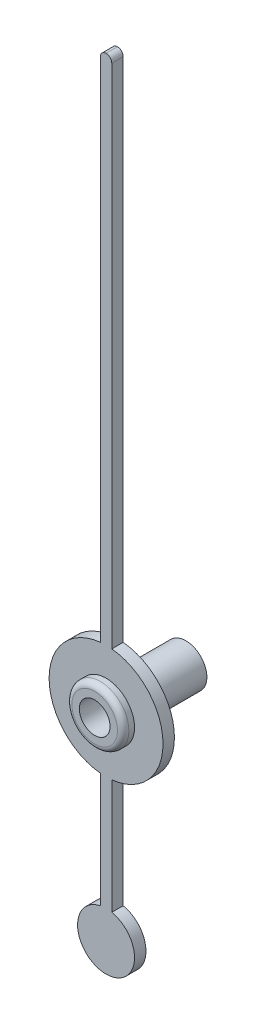
ISO-10303-21;
HEADER;
FILE_DESCRIPTION(('STEP AP214'),'2;1');
FILE_NAME('part.step','',(''),(''),'','','');
FILE_SCHEMA(('AUTOMOTIVE_DESIGN { 1 0 10303 214 1 1 1 1 }'));
ENDSEC;
DATA;
#1=APPLICATION_CONTEXT('core data for automotive mechanical design processes');
#2=APPLICATION_PROTOCOL_DEFINITION('international standard','automotive_design',2000,#1);
#3=PRODUCT_CONTEXT('',#1,'mechanical');
#4=PRODUCT('Part','Part','',(#3));
#5=PRODUCT_RELATED_PRODUCT_CATEGORY('part','',(#4));
#6=PRODUCT_DEFINITION_FORMATION('','',#4);
#7=PRODUCT_DEFINITION_CONTEXT('part definition',#1,'design');
#8=PRODUCT_DEFINITION('design','',#6,#7);
#9=PRODUCT_DEFINITION_SHAPE('','',#8);
#10=(LENGTH_UNIT() NAMED_UNIT(*) SI_UNIT(.MILLI.,.METRE.));
#11=(NAMED_UNIT(*) PLANE_ANGLE_UNIT() SI_UNIT($,.RADIAN.));
#12=(NAMED_UNIT(*) SI_UNIT($,.STERADIAN.) SOLID_ANGLE_UNIT());
#13=UNCERTAINTY_MEASURE_WITH_UNIT(LENGTH_MEASURE(1.E-05),#10,'distance_accuracy_value','');
#14=(GEOMETRIC_REPRESENTATION_CONTEXT(3) GLOBAL_UNCERTAINTY_ASSIGNED_CONTEXT((#13)) GLOBAL_UNIT_ASSIGNED_CONTEXT((#10,
#11,#12)) REPRESENTATION_CONTEXT('',''));
#15=CARTESIAN_POINT('',(0.,0.,0.));
#16=DIRECTION('',(0.,0.,1.));
#17=DIRECTION('',(1.,0.,0.));
#18=AXIS2_PLACEMENT_3D('',#15,#16,#17);
#19=CARTESIAN_POINT('',(0.,0.,-0.1));
#20=DIRECTION('',(0.,0.,1.));
#21=DIRECTION('',(1.,0.,0.));
#22=AXIS2_PLACEMENT_3D('',#19,#20,#21);
#23=PLANE('',#22);
#24=CARTESIAN_POINT('',(0.,0.,-0.1));
#25=DIRECTION('',(0.,0.,1.));
#26=DIRECTION('',(1.,0.,0.));
#27=AXIS2_PLACEMENT_3D('',#24,#25,#26);
#28=CIRCLE('',#27,0.2);
#29=CARTESIAN_POINT('',(0.2,0.,-0.1));
#30=VERTEX_POINT('',#29);
#31=EDGE_CURVE('E187',#30,#30,#28,.F.);
#32=ORIENTED_EDGE('',*,*,#31,.T.);
#33=EDGE_LOOP('',(#32));
#34=FACE_BOUND('',#33,.T.);
#35=CARTESIAN_POINT('',(0.,0.,-0.1));
#36=DIRECTION('',(0.,0.,1.));
#37=DIRECTION('',(1.,0.,0.));
#38=AXIS2_PLACEMENT_3D('',#35,#36,#37);
#39=CIRCLE('',#38,0.185);
#40=CARTESIAN_POINT('',(0.185,0.,-0.1));
#41=VERTEX_POINT('',#40);
#42=EDGE_CURVE('E11',#41,#41,#39,.F.);
#43=ORIENTED_EDGE('',*,*,#42,.F.);
#44=EDGE_LOOP('',(#43));
#45=FACE_BOUND('',#44,.T.);
#46=ADVANCED_FACE('F35',(#34,#45),#23,.F.);
#47=CARTESIAN_POINT('',(0.0499999999937245,4.99999999999773,0.1));
#48=DIRECTION('',(-1.,-1.35877854053416E-12,0.));
#49=DIRECTION('',(1.35877854053416E-12,-1.,0.));
#50=AXIS2_PLACEMENT_3D('',#47,#48,#49);
#51=PLANE('',#50);
#52=DIRECTION('',(-1.35877854053416E-12,1.,0.));
#53=VECTOR('',#52,1.);
#54=CARTESIAN_POINT('',(0.0499999999937245,4.99999999999773,0.));
#55=LINE('',#54,#53);
#56=CARTESIAN_POINT('',(0.0499999999998423,0.497493718553326,0.));
#57=VERTEX_POINT('',#56);
#58=CARTESIAN_POINT('',(0.0499999999937924,4.94999999999779,0.));
#59=VERTEX_POINT('',#58);
#60=EDGE_CURVE('E144',#57,#59,#55,.T.);
#61=ORIENTED_EDGE('',*,*,#60,.T.);
#62=DIRECTION('',(0.,0.,-1.));
#63=VECTOR('',#62,1.);
#64=CARTESIAN_POINT('',(0.0499999999937924,4.94999999999779,0.1));
#65=LINE('',#64,#63);
#66=CARTESIAN_POINT('',(0.0499999999937924,4.94999999999779,0.1));
#67=VERTEX_POINT('',#66);
#68=EDGE_CURVE('E58',#59,#67,#65,.F.);
#69=ORIENTED_EDGE('',*,*,#68,.T.);
#70=DIRECTION('',(-1.35877854053416E-12,1.,0.));
#71=VECTOR('',#70,1.);
#72=CARTESIAN_POINT('',(0.0499999999937245,4.99999999999773,0.1));
#73=LINE('',#72,#71);
#74=CARTESIAN_POINT('',(0.0499999999998423,0.497493718553326,0.1));
#75=VERTEX_POINT('',#74);
#76=EDGE_CURVE('E117',#75,#67,#73,.T.);
#77=ORIENTED_EDGE('',*,*,#76,.F.);
#78=DIRECTION('',(0.,0.,-1.));
#79=VECTOR('',#78,1.);
#80=CARTESIAN_POINT('',(0.0499999999998423,0.497493718553326,0.1));
#81=LINE('',#80,#79);
#82=EDGE_CURVE('E143',#75,#57,#81,.T.);
#83=ORIENTED_EDGE('',*,*,#82,.T.);
#84=EDGE_LOOP('',(#61,#69,#77,#83));
#85=FACE_BOUND('',#84,.T.);
#86=ADVANCED_FACE('F248',(#85),#51,.F.);
#87=CARTESIAN_POINT('',(-0.0499999999937594,4.99999999999773,0.1));
#88=DIRECTION('',(1.,-1.35179534916546E-12,0.));
#89=DIRECTION('',(1.35179534916546E-12,1.,0.));
#90=AXIS2_PLACEMENT_3D('',#87,#88,#89);
#91=PLANE('',#90);
#92=DIRECTION('',(-1.35179534916546E-12,-1.,0.));
#93=VECTOR('',#92,1.);
#94=CARTESIAN_POINT('',(-0.0499999999937594,4.99999999999773,0.1));
#95=LINE('',#94,#93);
#96=CARTESIAN_POINT('',(-0.049999999993827,4.94999999999779,0.1));
#97=VERTEX_POINT('',#96);
#98=CARTESIAN_POINT('',(-0.0499999999998459,0.497493718553326,0.1));
#99=VERTEX_POINT('',#98);
#100=EDGE_CURVE('E106',#97,#99,#95,.T.);
#101=ORIENTED_EDGE('',*,*,#100,.F.);
#102=DIRECTION('',(0.,0.,-1.));
#103=VECTOR('',#102,1.);
#104=CARTESIAN_POINT('',(-0.049999999993827,4.94999999999779,0.1));
#105=LINE('',#104,#103);
#106=CARTESIAN_POINT('',(-0.049999999993827,4.94999999999779,0.));
#107=VERTEX_POINT('',#106);
#108=EDGE_CURVE('E126',#97,#107,#105,.T.);
#109=ORIENTED_EDGE('',*,*,#108,.T.);
#110=DIRECTION('',(-1.35179534916546E-12,-1.,0.));
#111=VECTOR('',#110,1.);
#112=CARTESIAN_POINT('',(-0.0499999999937594,4.99999999999773,0.));
#113=LINE('',#112,#111);
#114=CARTESIAN_POINT('',(-0.0499999999998459,0.497493718553326,0.));
#115=VERTEX_POINT('',#114);
#116=EDGE_CURVE('E123',#107,#115,#113,.T.);
#117=ORIENTED_EDGE('',*,*,#116,.T.);
#118=DIRECTION('',(0.,0.,-1.));
#119=VECTOR('',#118,1.);
#120=CARTESIAN_POINT('',(-0.0499999999998459,0.497493718553326,0.1));
#121=LINE('',#120,#119);
#122=EDGE_CURVE('E120',#99,#115,#121,.T.);
#123=ORIENTED_EDGE('',*,*,#122,.F.);
#124=EDGE_LOOP('',(#101,#109,#117,#123));
#125=FACE_BOUND('',#124,.T.);
#126=ADVANCED_FACE('F121',(#125),#91,.F.);
#127=CARTESIAN_POINT('',(0.,0.,0.1));
#128=DIRECTION('',(0.,0.,-1.));
#129=DIRECTION('',(-1.,0.,0.));
#130=AXIS2_PLACEMENT_3D('',#127,#128,#129);
#131=CYLINDRICAL_SURFACE('',#130,0.5);
#132=CARTESIAN_POINT('',(0.,0.,0.));
#133=DIRECTION('',(0.,0.,1.));
#134=DIRECTION('',(1.,0.,0.));
#135=AXIS2_PLACEMENT_3D('',#132,#133,#134);
#136=CIRCLE('',#135,0.5);
#137=CARTESIAN_POINT('',(-0.0499999999998043,-0.49749371855333,0.));
#138=VERTEX_POINT('',#137);
#139=EDGE_CURVE('E148',#115,#138,#136,.T.);
#140=ORIENTED_EDGE('',*,*,#139,.T.);
#141=DIRECTION('',(0.,0.,-1.));
#142=VECTOR('',#141,1.);
#143=CARTESIAN_POINT('',(-0.0499999999998043,-0.49749371855333,0.1));
#144=LINE('',#143,#142);
#145=CARTESIAN_POINT('',(-0.0499999999998043,-0.49749371855333,0.1));
#146=VERTEX_POINT('',#145);
#147=EDGE_CURVE('E127',#146,#138,#144,.T.);
#148=ORIENTED_EDGE('',*,*,#147,.F.);
#149=CARTESIAN_POINT('',(0.,0.,0.1));
#150=DIRECTION('',(0.,0.,1.));
#151=DIRECTION('',(1.,0.,0.));
#152=AXIS2_PLACEMENT_3D('',#149,#150,#151);
#153=CIRCLE('',#152,0.5);
#154=EDGE_CURVE('E110',#99,#146,#153,.T.);
#155=ORIENTED_EDGE('',*,*,#154,.F.);
#156=ORIENTED_EDGE('',*,*,#122,.T.);
#157=EDGE_LOOP('',(#140,#148,#155,#156));
#158=FACE_BOUND('',#157,.T.);
#159=ADVANCED_FACE('F129',(#158),#131,.T.);
#160=CARTESIAN_POINT('',(-0.0499999999998041,-0.497493718553329,0.1));
#161=DIRECTION('',(1.,0.,0.));
#162=DIRECTION('',(0.,1.,0.));
#163=AXIS2_PLACEMENT_3D('',#160,#161,#162);
#164=PLANE('',#163);
#165=DIRECTION('',(0.,-1.,0.));
#166=VECTOR('',#165,1.);
#167=CARTESIAN_POINT('',(-0.0499999999998041,-0.497493718553329,0.));
#168=LINE('',#167,#166);
#169=CARTESIAN_POINT('',(-0.0499999999997618,-1.50505102572167,0.));
#170=VERTEX_POINT('',#169);
#171=EDGE_CURVE('E150',#138,#170,#168,.T.);
#172=ORIENTED_EDGE('',*,*,#171,.T.);
#173=DIRECTION('',(0.,0.,-1.));
#174=VECTOR('',#173,1.);
#175=CARTESIAN_POINT('',(-0.0499999999997618,-1.50505102572167,0.1));
#176=LINE('',#175,#174);
#177=CARTESIAN_POINT('',(-0.0499999999997618,-1.50505102572167,0.1));
#178=VERTEX_POINT('',#177);
#179=EDGE_CURVE('E166',#178,#170,#176,.T.);
#180=ORIENTED_EDGE('',*,*,#179,.F.);
#181=DIRECTION('',(0.,-1.,0.));
#182=VECTOR('',#181,1.);
#183=CARTESIAN_POINT('',(-0.0499999999998041,-0.497493718553329,0.1));
#184=LINE('',#183,#182);
#185=EDGE_CURVE('E132',#146,#178,#184,.T.);
#186=ORIENTED_EDGE('',*,*,#185,.F.);
#187=ORIENTED_EDGE('',*,*,#147,.T.);
#188=EDGE_LOOP('',(#172,#180,#186,#187));
#189=FACE_BOUND('',#188,.T.);
#190=ADVANCED_FACE('F233',(#189),#164,.F.);
#191=CARTESIAN_POINT('',(0.,-1.75000000000003,0.1));
#192=DIRECTION('',(0.,0.,-1.));
#193=DIRECTION('',(-1.,0.,0.));
#194=AXIS2_PLACEMENT_3D('',#191,#192,#193);
#195=CYLINDRICAL_SURFACE('',#194,0.249999999999999);
#196=CARTESIAN_POINT('',(0.,-1.75000000000003,0.));
#197=DIRECTION('',(0.,0.,1.));
#198=DIRECTION('',(1.,0.,0.));
#199=AXIS2_PLACEMENT_3D('',#196,#197,#198);
#200=CIRCLE('',#199,0.249999999999999);
#201=CARTESIAN_POINT('',(0.049999999999772,-1.50505102572167,0.));
#202=VERTEX_POINT('',#201);
#203=EDGE_CURVE('E152',#170,#202,#200,.T.);
#204=ORIENTED_EDGE('',*,*,#203,.T.);
#205=DIRECTION('',(0.,0.,-1.));
#206=VECTOR('',#205,1.);
#207=CARTESIAN_POINT('',(0.049999999999772,-1.50505102572167,0.1));
#208=LINE('',#207,#206);
#209=CARTESIAN_POINT('',(0.049999999999772,-1.50505102572167,0.1));
#210=VERTEX_POINT('',#209);
#211=EDGE_CURVE('E163',#210,#202,#208,.T.);
#212=ORIENTED_EDGE('',*,*,#211,.F.);
#213=CARTESIAN_POINT('',(0.,-1.75000000000003,0.1));
#214=DIRECTION('',(0.,0.,1.));
#215=DIRECTION('',(1.,0.,0.));
#216=AXIS2_PLACEMENT_3D('',#213,#214,#215);
#217=CIRCLE('',#216,0.249999999999999);
#218=EDGE_CURVE('E134',#178,#210,#217,.T.);
#219=ORIENTED_EDGE('',*,*,#218,.F.);
#220=ORIENTED_EDGE('',*,*,#179,.T.);
#221=EDGE_LOOP('',(#204,#212,#219,#220));
#222=FACE_BOUND('',#221,.T.);
#223=ADVANCED_FACE('F240',(#222),#195,.T.);
#224=CARTESIAN_POINT('',(0.0499999999998076,-0.497493718553329,0.1));
#225=DIRECTION('',(-1.,0.,0.));
#226=DIRECTION('',(0.,-1.,0.));
#227=AXIS2_PLACEMENT_3D('',#224,#225,#226);
#228=PLANE('',#227);
#229=DIRECTION('',(0.,1.,0.));
#230=VECTOR('',#229,1.);
#231=CARTESIAN_POINT('',(0.0499999999998076,-0.497493718553329,0.));
#232=LINE('',#231,#230);
#233=CARTESIAN_POINT('',(0.0499999999998076,-0.497493718553329,0.));
#234=VERTEX_POINT('',#233);
#235=EDGE_CURVE('E154',#202,#234,#232,.T.);
#236=ORIENTED_EDGE('',*,*,#235,.T.);
#237=DIRECTION('',(0.,0.,-1.));
#238=VECTOR('',#237,1.);
#239=CARTESIAN_POINT('',(0.0499999999998076,-0.497493718553329,0.1));
#240=LINE('',#239,#238);
#241=CARTESIAN_POINT('',(0.0499999999998076,-0.497493718553329,0.1));
#242=VERTEX_POINT('',#241);
#243=EDGE_CURVE('E160',#242,#234,#240,.T.);
#244=ORIENTED_EDGE('',*,*,#243,.F.);
#245=DIRECTION('',(0.,1.,0.));
#246=VECTOR('',#245,1.);
#247=CARTESIAN_POINT('',(0.0499999999998076,-0.497493718553329,0.1));
#248=LINE('',#247,#246);
#249=EDGE_CURVE('E139',#210,#242,#248,.T.);
#250=ORIENTED_EDGE('',*,*,#249,.F.);
#251=ORIENTED_EDGE('',*,*,#211,.T.);
#252=EDGE_LOOP('',(#236,#244,#250,#251));
#253=FACE_BOUND('',#252,.T.);
#254=ADVANCED_FACE('F243',(#253),#228,.F.);
#255=CARTESIAN_POINT('',(0.,0.,0.1));
#256=DIRECTION('',(0.,0.,-1.));
#257=DIRECTION('',(-1.,0.,0.));
#258=AXIS2_PLACEMENT_3D('',#255,#256,#257);
#259=CYLINDRICAL_SURFACE('',#258,0.5);
#260=CARTESIAN_POINT('',(0.,0.,0.));
#261=DIRECTION('',(0.,0.,1.));
#262=DIRECTION('',(1.,0.,0.));
#263=AXIS2_PLACEMENT_3D('',#260,#261,#262);
#264=CIRCLE('',#263,0.5);
#265=EDGE_CURVE('E156',#234,#57,#264,.T.);
#266=ORIENTED_EDGE('',*,*,#265,.T.);
#267=ORIENTED_EDGE('',*,*,#82,.F.);
#268=CARTESIAN_POINT('',(0.,0.,0.1));
#269=DIRECTION('',(0.,0.,1.));
#270=DIRECTION('',(1.,0.,0.));
#271=AXIS2_PLACEMENT_3D('',#268,#269,#270);
#272=CIRCLE('',#271,0.5);
#273=EDGE_CURVE('E141',#242,#75,#272,.T.);
#274=ORIENTED_EDGE('',*,*,#273,.F.);
#275=ORIENTED_EDGE('',*,*,#243,.T.);
#276=EDGE_LOOP('',(#266,#267,#274,#275));
#277=FACE_BOUND('',#276,.T.);
#278=ADVANCED_FACE('F246',(#277),#259,.T.);
#279=CARTESIAN_POINT('',(0.,0.,0.1));
#280=DIRECTION('',(0.,0.,1.));
#281=DIRECTION('',(1.,0.,0.));
#282=AXIS2_PLACEMENT_3D('',#279,#280,#281);
#283=PLANE('',#282);
#284=CARTESIAN_POINT('',(0.,0.,0.1));
#285=DIRECTION('',(0.,0.,1.));
#286=DIRECTION('',(1.,0.,0.));
#287=AXIS2_PLACEMENT_3D('',#284,#285,#286);
#288=CIRCLE('',#287,0.25);
#289=CARTESIAN_POINT('',(0.25,0.,0.1));
#290=VERTEX_POINT('',#289);
#291=EDGE_CURVE('E181',#290,#290,#288,.F.);
#292=ORIENTED_EDGE('',*,*,#291,.T.);
#293=EDGE_LOOP('',(#292));
#294=FACE_BOUND('',#293,.T.);
#295=CARTESIAN_POINT('',(-6.20757920977502E-12,4.94999999999773,0.1));
#296=DIRECTION('',(0.,0.,1.));
#297=DIRECTION('',(1.,0.,0.));
#298=AXIS2_PLACEMENT_3D('',#295,#296,#297);
#299=CIRCLE('',#298,0.05);
#300=CARTESIAN_POINT('',(-6.20757920977502E-12,4.99999999999773,0.1));
#301=VERTEX_POINT('',#300);
#302=EDGE_CURVE('E50',#67,#301,#299,.T.);
#303=ORIENTED_EDGE('',*,*,#302,.T.);
#304=CARTESIAN_POINT('',(6.17301695099618E-12,4.94999999999773,0.1));
#305=DIRECTION('',(0.,0.,1.));
#306=DIRECTION('',(1.,0.,0.));
#307=AXIS2_PLACEMENT_3D('',#304,#305,#306);
#308=CIRCLE('',#307,0.05);
#309=EDGE_CURVE('E113',#301,#97,#308,.T.);
#310=ORIENTED_EDGE('',*,*,#309,.T.);
#311=ORIENTED_EDGE('',*,*,#100,.T.);
#312=ORIENTED_EDGE('',*,*,#154,.T.);
#313=ORIENTED_EDGE('',*,*,#185,.T.);
#314=ORIENTED_EDGE('',*,*,#218,.T.);
#315=ORIENTED_EDGE('',*,*,#249,.T.);
#316=ORIENTED_EDGE('',*,*,#273,.T.);
#317=ORIENTED_EDGE('',*,*,#76,.T.);
#318=EDGE_LOOP('',(#303,#310,#311,#312,#313,#314,#315,#316,#317));
#319=FACE_BOUND('',#318,.T.);
#320=ADVANCED_FACE('F108',(#294,#319),#283,.T.);
#321=CARTESIAN_POINT('',(0.,0.,0.));
#322=DIRECTION('',(0.,0.,1.));
#323=DIRECTION('',(1.,0.,0.));
#324=AXIS2_PLACEMENT_3D('',#321,#322,#323);
#325=PLANE('',#324);
#326=CARTESIAN_POINT('',(0.,0.,0.));
#327=DIRECTION('',(0.,0.,1.));
#328=DIRECTION('',(1.,0.,0.));
#329=AXIS2_PLACEMENT_3D('',#326,#327,#328);
#330=CIRCLE('',#329,0.25);
#331=CARTESIAN_POINT('',(0.25,0.,0.));
#332=VERTEX_POINT('',#331);
#333=EDGE_CURVE('E178',#332,#332,#330,.F.);
#334=ORIENTED_EDGE('',*,*,#333,.F.);
#335=EDGE_LOOP('',(#334));
#336=FACE_BOUND('',#335,.T.);
#337=ORIENTED_EDGE('',*,*,#116,.F.);
#338=CARTESIAN_POINT('',(6.17301695099618E-12,4.94999999999773,0.));
#339=DIRECTION('',(0.,0.,1.));
#340=DIRECTION('',(1.,0.,0.));
#341=AXIS2_PLACEMENT_3D('',#338,#339,#340);
#342=CIRCLE('',#341,0.05);
#343=CARTESIAN_POINT('',(-6.20757920977502E-12,4.99999999999773,0.));
#344=VERTEX_POINT('',#343);
#345=EDGE_CURVE('E173',#107,#344,#342,.F.);
#346=ORIENTED_EDGE('',*,*,#345,.T.);
#347=CARTESIAN_POINT('',(-6.20757920977502E-12,4.94999999999773,0.));
#348=DIRECTION('',(0.,0.,1.));
#349=DIRECTION('',(1.,0.,0.));
#350=AXIS2_PLACEMENT_3D('',#347,#348,#349);
#351=CIRCLE('',#350,0.05);
#352=EDGE_CURVE('E171',#344,#59,#351,.F.);
#353=ORIENTED_EDGE('',*,*,#352,.T.);
#354=ORIENTED_EDGE('',*,*,#60,.F.);
#355=ORIENTED_EDGE('',*,*,#265,.F.);
#356=ORIENTED_EDGE('',*,*,#235,.F.);
#357=ORIENTED_EDGE('',*,*,#203,.F.);
#358=ORIENTED_EDGE('',*,*,#171,.F.);
#359=ORIENTED_EDGE('',*,*,#139,.F.);
#360=EDGE_LOOP('',(#337,#346,#353,#354,#355,#356,#357,#358,#359));
#361=FACE_BOUND('',#360,.T.);
#362=ADVANCED_FACE('F229',(#336,#361),#325,.F.);
#363=CARTESIAN_POINT('',(-6.20757920977502E-12,4.94999999999773,0.1));
#364=DIRECTION('',(0.,0.,-1.));
#365=DIRECTION('',(-1.,0.,0.));
#366=AXIS2_PLACEMENT_3D('',#363,#364,#365);
#367=CYLINDRICAL_SURFACE('',#366,0.05);
#368=DIRECTION('',(0.,0.,-1.));
#369=VECTOR('',#368,1.);
#370=CARTESIAN_POINT('',(-6.20757920977502E-12,4.99999999999773,0.1));
#371=LINE('',#370,#369);
#372=EDGE_CURVE('E146',#301,#344,#371,.T.);
#373=ORIENTED_EDGE('',*,*,#372,.F.);
#374=ORIENTED_EDGE('',*,*,#302,.F.);
#375=ORIENTED_EDGE('',*,*,#68,.F.);
#376=ORIENTED_EDGE('',*,*,#352,.F.);
#377=EDGE_LOOP('',(#373,#374,#375,#376));
#378=FACE_BOUND('',#377,.T.);
#379=ADVANCED_FACE('F224',(#378),#367,.T.);
#380=CARTESIAN_POINT('',(6.17301695099618E-12,4.94999999999773,0.1));
#381=DIRECTION('',(0.,0.,-1.));
#382=DIRECTION('',(-1.,0.,0.));
#383=AXIS2_PLACEMENT_3D('',#380,#381,#382);
#384=CYLINDRICAL_SURFACE('',#383,0.05);
#385=ORIENTED_EDGE('',*,*,#309,.F.);
#386=ORIENTED_EDGE('',*,*,#372,.T.);
#387=ORIENTED_EDGE('',*,*,#345,.F.);
#388=ORIENTED_EDGE('',*,*,#108,.F.);
#389=EDGE_LOOP('',(#385,#386,#387,#388));
#390=FACE_BOUND('',#389,.T.);
#391=ADVANCED_FACE('F227',(#390),#384,.T.);
#392=CARTESIAN_POINT('',(0.,0.,0.2));
#393=DIRECTION('',(0.,0.,-1.));
#394=DIRECTION('',(-1.,0.,0.));
#395=AXIS2_PLACEMENT_3D('',#392,#393,#394);
#396=CYLINDRICAL_SURFACE('',#395,0.25);
#397=CARTESIAN_POINT('',(0.,0.,-0.05));
#398=DIRECTION('',(0.,0.,1.));
#399=DIRECTION('',(1.,0.,0.));
#400=AXIS2_PLACEMENT_3D('',#397,#398,#399);
#401=CIRCLE('',#400,0.25);
#402=CARTESIAN_POINT('',(0.25,0.,-0.05));
#403=VERTEX_POINT('',#402);
#404=EDGE_CURVE('E184',#403,#403,#401,.T.);
#405=ORIENTED_EDGE('',*,*,#404,.T.);
#406=EDGE_LOOP('',(#405));
#407=FACE_BOUND('',#406,.T.);
#408=ORIENTED_EDGE('',*,*,#333,.T.);
#409=EDGE_LOOP('',(#408));
#410=FACE_BOUND('',#409,.T.);
#411=ADVANCED_FACE('F262',(#407,#410),#396,.T.);
#412=CARTESIAN_POINT('',(0.,0.,0.15));
#413=DIRECTION('',(0.,0.,1.));
#414=DIRECTION('',(1.,0.,0.));
#415=AXIS2_PLACEMENT_3D('',#412,#413,#414);
#416=CIRCLE('',#415,0.25);
#417=CARTESIAN_POINT('',(0.25,0.,0.15));
#418=VERTEX_POINT('',#417);
#419=EDGE_CURVE('E43',#418,#418,#416,.F.);
#420=ORIENTED_EDGE('',*,*,#419,.T.);
#421=EDGE_LOOP('',(#420));
#422=FACE_BOUND('',#421,.T.);
#423=ORIENTED_EDGE('',*,*,#291,.F.);
#424=EDGE_LOOP('',(#423));
#425=FACE_BOUND('',#424,.T.);
#426=ADVANCED_FACE('F195',(#422,#425),#396,.T.);
#427=CARTESIAN_POINT('',(0.,0.,0.2));
#428=DIRECTION('',(0.,0.,1.));
#429=DIRECTION('',(1.,0.,0.));
#430=AXIS2_PLACEMENT_3D('',#427,#428,#429);
#431=PLANE('',#430);
#432=CARTESIAN_POINT('',(0.,0.,0.2));
#433=DIRECTION('',(0.,0.,1.));
#434=DIRECTION('',(1.,0.,0.));
#435=AXIS2_PLACEMENT_3D('',#432,#433,#434);
#436=CIRCLE('',#435,0.2);
#437=CARTESIAN_POINT('',(0.2,0.,0.2));
#438=VERTEX_POINT('',#437);
#439=EDGE_CURVE('E190',#438,#438,#436,.T.);
#440=ORIENTED_EDGE('',*,*,#439,.T.);
#441=EDGE_LOOP('',(#440));
#442=FACE_BOUND('',#441,.T.);
#443=CARTESIAN_POINT('',(0.,0.,0.2));
#444=DIRECTION('',(0.,0.,1.));
#445=DIRECTION('',(1.,0.,0.));
#446=AXIS2_PLACEMENT_3D('',#443,#444,#445);
#447=CIRCLE('',#446,0.135);
#448=CARTESIAN_POINT('',(0.135,0.,0.2));
#449=VERTEX_POINT('',#448);
#450=EDGE_CURVE('E211',#449,#449,#447,.T.);
#451=ORIENTED_EDGE('',*,*,#450,.F.);
#452=EDGE_LOOP('',(#451));
#453=FACE_BOUND('',#452,.T.);
#454=ADVANCED_FACE('F204',(#442,#453),#431,.T.);
#455=CARTESIAN_POINT('',(0.,0.,-0.1));
#456=DIRECTION('',(0.,0.,1.));
#457=DIRECTION('',(1.,0.,0.));
#458=AXIS2_PLACEMENT_3D('',#455,#456,#457);
#459=CYLINDRICAL_SURFACE('',#458,0.135);
#460=ORIENTED_EDGE('',*,*,#450,.T.);
#461=EDGE_LOOP('',(#460));
#462=FACE_BOUND('',#461,.T.);
#463=CARTESIAN_POINT('',(0.,0.,-0.6));
#464=DIRECTION('',(0.,0.,-1.));
#465=DIRECTION('',(-1.,0.,0.));
#466=AXIS2_PLACEMENT_3D('',#463,#464,#465);
#467=CIRCLE('',#466,0.135);
#468=CARTESIAN_POINT('',(-0.135,0.,-0.6));
#469=VERTEX_POINT('',#468);
#470=EDGE_CURVE('E218',#469,#469,#467,.T.);
#471=ORIENTED_EDGE('',*,*,#470,.T.);
#472=EDGE_LOOP('',(#471));
#473=FACE_BOUND('',#472,.T.);
#474=ADVANCED_FACE('F207',(#462,#473),#459,.F.);
#475=CARTESIAN_POINT('',(0.,0.,-0.05));
#476=DIRECTION('',(0.,0.,1.));
#477=DIRECTION('',(1.,0.,0.));
#478=AXIS2_PLACEMENT_3D('',#475,#476,#477);
#479=TOROIDAL_SURFACE('',#478,0.2,0.05);
#480=ORIENTED_EDGE('',*,*,#31,.F.);
#481=EDGE_LOOP('',(#480));
#482=FACE_BOUND('',#481,.T.);
#483=ORIENTED_EDGE('',*,*,#404,.F.);
#484=EDGE_LOOP('',(#483));
#485=FACE_BOUND('',#484,.T.);
#486=ADVANCED_FACE('F201',(#482,#485),#479,.T.);
#487=CARTESIAN_POINT('',(0.,0.,0.15));
#488=DIRECTION('',(0.,0.,1.));
#489=DIRECTION('',(1.,0.,0.));
#490=AXIS2_PLACEMENT_3D('',#487,#488,#489);
#491=TOROIDAL_SURFACE('',#490,0.2,0.05);
#492=ORIENTED_EDGE('',*,*,#419,.F.);
#493=EDGE_LOOP('',(#492));
#494=FACE_BOUND('',#493,.T.);
#495=ORIENTED_EDGE('',*,*,#439,.F.);
#496=EDGE_LOOP('',(#495));
#497=FACE_BOUND('',#496,.T.);
#498=ADVANCED_FACE('F37',(#494,#497),#491,.T.);
#499=CARTESIAN_POINT('',(0.,0.,-0.6));
#500=DIRECTION('',(0.,0.,-1.));
#501=DIRECTION('',(-1.,0.,0.));
#502=AXIS2_PLACEMENT_3D('',#499,#500,#501);
#503=PLANE('',#502);
#504=CARTESIAN_POINT('',(0.,0.,-0.6));
#505=DIRECTION('',(0.,0.,-1.));
#506=DIRECTION('',(-1.,0.,0.));
#507=AXIS2_PLACEMENT_3D('',#504,#505,#506);
#508=CIRCLE('',#507,0.185);
#509=CARTESIAN_POINT('',(-0.185,0.,-0.6));
#510=VERTEX_POINT('',#509);
#511=EDGE_CURVE('E213',#510,#510,#508,.T.);
#512=ORIENTED_EDGE('',*,*,#511,.T.);
#513=EDGE_LOOP('',(#512));
#514=FACE_BOUND('',#513,.T.);
#515=ORIENTED_EDGE('',*,*,#470,.F.);
#516=EDGE_LOOP('',(#515));
#517=FACE_BOUND('',#516,.T.);
#518=ADVANCED_FACE('F200',(#514,#517),#503,.T.);
#519=CARTESIAN_POINT('',(0.,0.,-0.6));
#520=DIRECTION('',(0.,0.,1.));
#521=DIRECTION('',(1.,0.,0.));
#522=AXIS2_PLACEMENT_3D('',#519,#520,#521);
#523=CYLINDRICAL_SURFACE('',#522,0.185);
#524=ORIENTED_EDGE('',*,*,#511,.F.);
#525=EDGE_LOOP('',(#524));
#526=FACE_BOUND('',#525,.T.);
#527=ORIENTED_EDGE('',*,*,#42,.T.);
#528=EDGE_LOOP('',(#527));
#529=FACE_BOUND('',#528,.T.);
#530=ADVANCED_FACE('F378',(#526,#529),#523,.T.);
#531=CLOSED_SHELL('',(#46,#86,#126,#159,#190,#223,#254,#278,#320,#362,#379,#391,#411,#426,#454,
#474,#486,#498,#518,#530));
#532=MANIFOLD_SOLID_BREP('B2',#531);
#533=ADVANCED_BREP_SHAPE_REPRESENTATION('',(#18,#532),#14);
#534=SHAPE_DEFINITION_REPRESENTATION(#9,#533);
ENDSEC;
END-ISO-10303-21;
